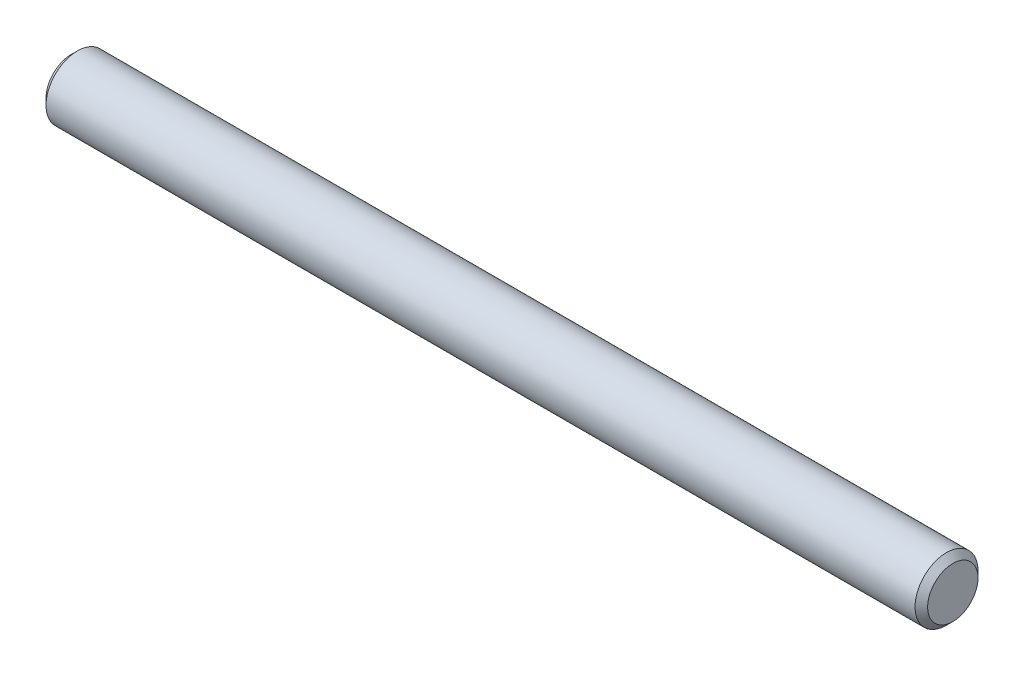
ISO-10303-21;
HEADER;
FILE_DESCRIPTION(('STEP AP214'),'2;1');
FILE_NAME('part.step','',(''),(''),'','','');
FILE_SCHEMA(('AUTOMOTIVE_DESIGN { 1 0 10303 214 1 1 1 1 }'));
ENDSEC;
DATA;
#1=APPLICATION_CONTEXT('core data for automotive mechanical design processes');
#2=APPLICATION_PROTOCOL_DEFINITION('international standard','automotive_design',2000,#1);
#3=PRODUCT_CONTEXT('',#1,'mechanical');
#4=PRODUCT('Part','Part','',(#3));
#5=PRODUCT_RELATED_PRODUCT_CATEGORY('part','',(#4));
#6=PRODUCT_DEFINITION_FORMATION('','',#4);
#7=PRODUCT_DEFINITION_CONTEXT('part definition',#1,'design');
#8=PRODUCT_DEFINITION('design','',#6,#7);
#9=PRODUCT_DEFINITION_SHAPE('','',#8);
#10=(LENGTH_UNIT() NAMED_UNIT(*) SI_UNIT(.MILLI.,.METRE.));
#11=(NAMED_UNIT(*) PLANE_ANGLE_UNIT() SI_UNIT($,.RADIAN.));
#12=(NAMED_UNIT(*) SI_UNIT($,.STERADIAN.) SOLID_ANGLE_UNIT());
#13=UNCERTAINTY_MEASURE_WITH_UNIT(LENGTH_MEASURE(1.E-05),#10,'distance_accuracy_value','');
#14=(GEOMETRIC_REPRESENTATION_CONTEXT(3) GLOBAL_UNCERTAINTY_ASSIGNED_CONTEXT((#13)) GLOBAL_UNIT_ASSIGNED_CONTEXT((#10,
#11,#12)) REPRESENTATION_CONTEXT('',''));
#15=CARTESIAN_POINT('',(0.,0.,0.));
#16=DIRECTION('',(0.,0.,1.));
#17=DIRECTION('',(1.,0.,0.));
#18=AXIS2_PLACEMENT_3D('',#15,#16,#17);
#19=CARTESIAN_POINT('',(-11.1125,0.,0.));
#20=DIRECTION('',(1.,0.,0.));
#21=DIRECTION('',(0.,0.,-1.));
#22=AXIS2_PLACEMENT_3D('',#19,#20,#21);
#23=CYLINDRICAL_SURFACE('',#22,0.79375);
#24=CARTESIAN_POINT('',(10.95375,0.,0.));
#25=DIRECTION('',(1.,0.,0.));
#26=DIRECTION('',(0.,0.,-1.));
#27=AXIS2_PLACEMENT_3D('',#24,#25,#26);
#28=CIRCLE('',#27,0.79375);
#29=CARTESIAN_POINT('',(10.95375,0.,-0.79375));
#30=VERTEX_POINT('',#29);
#31=EDGE_CURVE('E37',#30,#30,#28,.F.);
#32=ORIENTED_EDGE('',*,*,#31,.T.);
#33=EDGE_LOOP('',(#32));
#34=FACE_BOUND('',#33,.T.);
#35=CARTESIAN_POINT('',(-10.95375,0.,0.));
#36=DIRECTION('',(1.,0.,0.));
#37=DIRECTION('',(0.,0.,-1.));
#38=AXIS2_PLACEMENT_3D('',#35,#36,#37);
#39=CIRCLE('',#38,0.79375);
#40=CARTESIAN_POINT('',(-10.95375,0.,-0.79375));
#41=VERTEX_POINT('',#40);
#42=EDGE_CURVE('E41',#41,#41,#39,.T.);
#43=ORIENTED_EDGE('',*,*,#42,.T.);
#44=EDGE_LOOP('',(#43));
#45=FACE_BOUND('',#44,.T.);
#46=ADVANCED_FACE('F30',(#34,#45),#23,.T.);
#47=CARTESIAN_POINT('',(-11.1125,0.,0.));
#48=DIRECTION('',(1.,0.,0.));
#49=DIRECTION('',(0.,0.,-1.));
#50=AXIS2_PLACEMENT_3D('',#47,#48,#49);
#51=PLANE('',#50);
#52=CARTESIAN_POINT('',(-11.1125,0.,0.));
#53=DIRECTION('',(1.,0.,0.));
#54=DIRECTION('',(0.,0.,-1.));
#55=AXIS2_PLACEMENT_3D('',#52,#53,#54);
#56=CIRCLE('',#55,0.635000000000002);
#57=CARTESIAN_POINT('',(-11.1125,0.,-0.635000000000002));
#58=VERTEX_POINT('',#57);
#59=EDGE_CURVE('E10',#58,#58,#56,.F.);
#60=ORIENTED_EDGE('',*,*,#59,.T.);
#61=EDGE_LOOP('',(#60));
#62=FACE_BOUND('',#61,.T.);
#63=ADVANCED_FACE('F61',(#62),#51,.F.);
#64=CARTESIAN_POINT('',(11.1125,0.,0.));
#65=DIRECTION('',(1.,0.,0.));
#66=DIRECTION('',(0.,0.,-1.));
#67=AXIS2_PLACEMENT_3D('',#64,#65,#66);
#68=PLANE('',#67);
#69=CARTESIAN_POINT('',(11.1125,0.,0.));
#70=DIRECTION('',(1.,0.,0.));
#71=DIRECTION('',(0.,0.,-1.));
#72=AXIS2_PLACEMENT_3D('',#69,#70,#71);
#73=CIRCLE('',#72,0.635000000000004);
#74=CARTESIAN_POINT('',(11.1125,0.,-0.635000000000004));
#75=VERTEX_POINT('',#74);
#76=EDGE_CURVE('E45',#75,#75,#73,.T.);
#77=ORIENTED_EDGE('',*,*,#76,.T.);
#78=EDGE_LOOP('',(#77));
#79=FACE_BOUND('',#78,.T.);
#80=ADVANCED_FACE('F51',(#79),#68,.T.);
#81=CARTESIAN_POINT('',(11.1125,0.,0.));
#82=DIRECTION('',(-1.,0.,0.));
#83=DIRECTION('',(0.,0.,1.));
#84=AXIS2_PLACEMENT_3D('',#81,#82,#83);
#85=CONICAL_SURFACE('',#84,0.635000000000004,0.78539816339745);
#86=ORIENTED_EDGE('',*,*,#31,.F.);
#87=EDGE_LOOP('',(#86));
#88=FACE_BOUND('',#87,.T.);
#89=ORIENTED_EDGE('',*,*,#76,.F.);
#90=EDGE_LOOP('',(#89));
#91=FACE_BOUND('',#90,.T.);
#92=ADVANCED_FACE('F53',(#88,#91),#85,.T.);
#93=CARTESIAN_POINT('',(-10.95375,0.,0.));
#94=DIRECTION('',(1.,0.,0.));
#95=DIRECTION('',(0.,0.,-1.));
#96=AXIS2_PLACEMENT_3D('',#93,#94,#95);
#97=CONICAL_SURFACE('',#96,0.79375,0.785398163397439);
#98=ORIENTED_EDGE('',*,*,#59,.F.);
#99=EDGE_LOOP('',(#98));
#100=FACE_BOUND('',#99,.T.);
#101=ORIENTED_EDGE('',*,*,#42,.F.);
#102=EDGE_LOOP('',(#101));
#103=FACE_BOUND('',#102,.T.);
#104=ADVANCED_FACE('F32',(#100,#103),#97,.T.);
#105=CLOSED_SHELL('',(#46,#63,#80,#92,#104));
#106=MANIFOLD_SOLID_BREP('B2',#105);
#107=ADVANCED_BREP_SHAPE_REPRESENTATION('',(#18,#106),#14);
#108=SHAPE_DEFINITION_REPRESENTATION(#9,#107);
ENDSEC;
END-ISO-10303-21;
